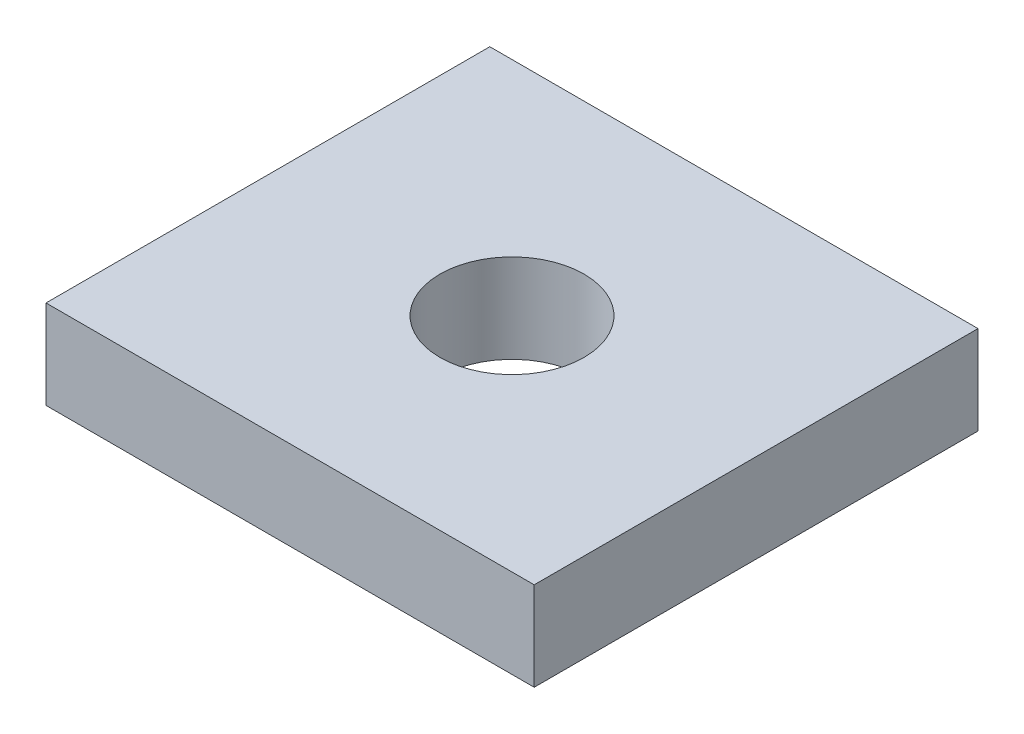
ISO-10303-21;
HEADER;
FILE_DESCRIPTION(('STEP AP214'),'2;1');
FILE_NAME('part.step','',(''),(''),'','','');
FILE_SCHEMA(('AUTOMOTIVE_DESIGN { 1 0 10303 214 1 1 1 1 }'));
ENDSEC;
DATA;
#1=APPLICATION_CONTEXT('core data for automotive mechanical design processes');
#2=APPLICATION_PROTOCOL_DEFINITION('international standard','automotive_design',2000,#1);
#3=PRODUCT_CONTEXT('',#1,'mechanical');
#4=PRODUCT('Part','Part','',(#3));
#5=PRODUCT_RELATED_PRODUCT_CATEGORY('part','',(#4));
#6=PRODUCT_DEFINITION_FORMATION('','',#4);
#7=PRODUCT_DEFINITION_CONTEXT('part definition',#1,'design');
#8=PRODUCT_DEFINITION('design','',#6,#7);
#9=PRODUCT_DEFINITION_SHAPE('','',#8);
#10=(LENGTH_UNIT() NAMED_UNIT(*) SI_UNIT(.MILLI.,.METRE.));
#11=(NAMED_UNIT(*) PLANE_ANGLE_UNIT() SI_UNIT($,.RADIAN.));
#12=(NAMED_UNIT(*) SI_UNIT($,.STERADIAN.) SOLID_ANGLE_UNIT());
#13=UNCERTAINTY_MEASURE_WITH_UNIT(LENGTH_MEASURE(1.E-05),#10,'distance_accuracy_value','');
#14=(GEOMETRIC_REPRESENTATION_CONTEXT(3) GLOBAL_UNCERTAINTY_ASSIGNED_CONTEXT((#13)) GLOBAL_UNIT_ASSIGNED_CONTEXT((#10,
#11,#12)) REPRESENTATION_CONTEXT('',''));
#15=CARTESIAN_POINT('',(0.,0.,0.));
#16=DIRECTION('',(0.,0.,1.));
#17=DIRECTION('',(1.,0.,0.));
#18=AXIS2_PLACEMENT_3D('',#15,#16,#17);
#19=CARTESIAN_POINT('',(-11.,4.,10.));
#20=DIRECTION('',(0.,1.,0.));
#21=DIRECTION('',(0.,0.,1.));
#22=AXIS2_PLACEMENT_3D('',#19,#20,#21);
#23=PLANE('',#22);
#24=DIRECTION('',(0.,0.,1.));
#25=VECTOR('',#24,1.);
#26=CARTESIAN_POINT('',(-11.,4.,-10.));
#27=LINE('',#26,#25);
#28=CARTESIAN_POINT('',(-11.,4.,-10.));
#29=VERTEX_POINT('',#28);
#30=CARTESIAN_POINT('',(-11.,4.,10.));
#31=VERTEX_POINT('',#30);
#32=EDGE_CURVE('E86',#29,#31,#27,.T.);
#33=ORIENTED_EDGE('',*,*,#32,.T.);
#34=DIRECTION('',(1.,0.,0.));
#35=VECTOR('',#34,1.);
#36=CARTESIAN_POINT('',(-11.,4.,10.));
#37=LINE('',#36,#35);
#38=CARTESIAN_POINT('',(11.,4.,10.));
#39=VERTEX_POINT('',#38);
#40=EDGE_CURVE('E81',#31,#39,#37,.T.);
#41=ORIENTED_EDGE('',*,*,#40,.T.);
#42=DIRECTION('',(0.,0.,-1.));
#43=VECTOR('',#42,1.);
#44=CARTESIAN_POINT('',(11.,4.,-10.));
#45=LINE('',#44,#43);
#46=CARTESIAN_POINT('',(11.,4.,-10.));
#47=VERTEX_POINT('',#46);
#48=EDGE_CURVE('E84',#39,#47,#45,.T.);
#49=ORIENTED_EDGE('',*,*,#48,.T.);
#50=DIRECTION('',(-1.,0.,0.));
#51=VECTOR('',#50,1.);
#52=CARTESIAN_POINT('',(-11.,4.,-10.));
#53=LINE('',#52,#51);
#54=EDGE_CURVE('E51',#47,#29,#53,.T.);
#55=ORIENTED_EDGE('',*,*,#54,.T.);
#56=EDGE_LOOP('',(#33,#41,#49,#55));
#57=FACE_BOUND('',#56,.T.);
#58=CARTESIAN_POINT('',(0.,4.,0.));
#59=DIRECTION('',(0.,1.,0.));
#60=DIRECTION('',(0.,0.,1.));
#61=AXIS2_PLACEMENT_3D('',#58,#59,#60);
#62=CIRCLE('',#61,3.25);
#63=CARTESIAN_POINT('',(0.,4.,3.25));
#64=VERTEX_POINT('',#63);
#65=EDGE_CURVE('E101',#64,#64,#62,.T.);
#66=ORIENTED_EDGE('',*,*,#65,.F.);
#67=EDGE_LOOP('',(#66));
#68=FACE_BOUND('',#67,.T.);
#69=ADVANCED_FACE('F34',(#57,#68),#23,.T.);
#70=CARTESIAN_POINT('',(-11.,0.,10.));
#71=DIRECTION('',(0.,1.,0.));
#72=DIRECTION('',(0.,0.,1.));
#73=AXIS2_PLACEMENT_3D('',#70,#71,#72);
#74=PLANE('',#73);
#75=DIRECTION('',(0.,0.,1.));
#76=VECTOR('',#75,1.);
#77=CARTESIAN_POINT('',(-11.,0.,-10.));
#78=LINE('',#77,#76);
#79=CARTESIAN_POINT('',(-11.,0.,-10.));
#80=VERTEX_POINT('',#79);
#81=CARTESIAN_POINT('',(-11.,0.,10.));
#82=VERTEX_POINT('',#81);
#83=EDGE_CURVE('E98',#80,#82,#78,.T.);
#84=ORIENTED_EDGE('',*,*,#83,.F.);
#85=DIRECTION('',(-1.,0.,0.));
#86=VECTOR('',#85,1.);
#87=CARTESIAN_POINT('',(-11.,0.,-10.));
#88=LINE('',#87,#86);
#89=CARTESIAN_POINT('',(11.,0.,-10.));
#90=VERTEX_POINT('',#89);
#91=EDGE_CURVE('E74',#90,#80,#88,.T.);
#92=ORIENTED_EDGE('',*,*,#91,.F.);
#93=DIRECTION('',(0.,0.,-1.));
#94=VECTOR('',#93,1.);
#95=CARTESIAN_POINT('',(11.,0.,-10.));
#96=LINE('',#95,#94);
#97=CARTESIAN_POINT('',(11.,0.,10.));
#98=VERTEX_POINT('',#97);
#99=EDGE_CURVE('E68',#98,#90,#96,.T.);
#100=ORIENTED_EDGE('',*,*,#99,.F.);
#101=DIRECTION('',(1.,0.,0.));
#102=VECTOR('',#101,1.);
#103=CARTESIAN_POINT('',(-11.,0.,10.));
#104=LINE('',#103,#102);
#105=EDGE_CURVE('E90',#82,#98,#104,.T.);
#106=ORIENTED_EDGE('',*,*,#105,.F.);
#107=EDGE_LOOP('',(#84,#92,#100,#106));
#108=FACE_BOUND('',#107,.T.);
#109=CARTESIAN_POINT('',(0.,0.,0.));
#110=DIRECTION('',(0.,1.,0.));
#111=DIRECTION('',(0.,0.,1.));
#112=AXIS2_PLACEMENT_3D('',#109,#110,#111);
#113=CIRCLE('',#112,3.25);
#114=CARTESIAN_POINT('',(0.,0.,3.25));
#115=VERTEX_POINT('',#114);
#116=EDGE_CURVE('E113',#115,#115,#113,.T.);
#117=ORIENTED_EDGE('',*,*,#116,.T.);
#118=EDGE_LOOP('',(#117));
#119=FACE_BOUND('',#118,.T.);
#120=ADVANCED_FACE('F109',(#108,#119),#74,.F.);
#121=CARTESIAN_POINT('',(-11.,4.,-10.));
#122=DIRECTION('',(1.,0.,0.));
#123=DIRECTION('',(0.,0.,-1.));
#124=AXIS2_PLACEMENT_3D('',#121,#122,#123);
#125=PLANE('',#124);
#126=ORIENTED_EDGE('',*,*,#83,.T.);
#127=DIRECTION('',(0.,-1.,0.));
#128=VECTOR('',#127,1.);
#129=CARTESIAN_POINT('',(-11.,4.,10.));
#130=LINE('',#129,#128);
#131=EDGE_CURVE('E11',#31,#82,#130,.T.);
#132=ORIENTED_EDGE('',*,*,#131,.F.);
#133=ORIENTED_EDGE('',*,*,#32,.F.);
#134=DIRECTION('',(0.,-1.,0.));
#135=VECTOR('',#134,1.);
#136=CARTESIAN_POINT('',(-11.,4.,-10.));
#137=LINE('',#136,#135);
#138=EDGE_CURVE('E94',#29,#80,#137,.T.);
#139=ORIENTED_EDGE('',*,*,#138,.T.);
#140=EDGE_LOOP('',(#126,#132,#133,#139));
#141=FACE_BOUND('',#140,.T.);
#142=ADVANCED_FACE('F36',(#141),#125,.F.);
#143=CARTESIAN_POINT('',(-11.,4.,10.));
#144=DIRECTION('',(0.,0.,-1.));
#145=DIRECTION('',(-1.,0.,0.));
#146=AXIS2_PLACEMENT_3D('',#143,#144,#145);
#147=PLANE('',#146);
#148=ORIENTED_EDGE('',*,*,#105,.T.);
#149=DIRECTION('',(0.,-1.,0.));
#150=VECTOR('',#149,1.);
#151=CARTESIAN_POINT('',(11.,4.,10.));
#152=LINE('',#151,#150);
#153=EDGE_CURVE('E43',#39,#98,#152,.T.);
#154=ORIENTED_EDGE('',*,*,#153,.F.);
#155=ORIENTED_EDGE('',*,*,#40,.F.);
#156=ORIENTED_EDGE('',*,*,#131,.T.);
#157=EDGE_LOOP('',(#148,#154,#155,#156));
#158=FACE_BOUND('',#157,.T.);
#159=ADVANCED_FACE('F89',(#158),#147,.F.);
#160=CARTESIAN_POINT('',(11.,4.,-10.));
#161=DIRECTION('',(-1.,0.,0.));
#162=DIRECTION('',(0.,0.,1.));
#163=AXIS2_PLACEMENT_3D('',#160,#161,#162);
#164=PLANE('',#163);
#165=ORIENTED_EDGE('',*,*,#99,.T.);
#166=DIRECTION('',(0.,-1.,0.));
#167=VECTOR('',#166,1.);
#168=CARTESIAN_POINT('',(11.,4.,-10.));
#169=LINE('',#168,#167);
#170=EDGE_CURVE('E91',#47,#90,#169,.T.);
#171=ORIENTED_EDGE('',*,*,#170,.F.);
#172=ORIENTED_EDGE('',*,*,#48,.F.);
#173=ORIENTED_EDGE('',*,*,#153,.T.);
#174=EDGE_LOOP('',(#165,#171,#172,#173));
#175=FACE_BOUND('',#174,.T.);
#176=ADVANCED_FACE('F92',(#175),#164,.F.);
#177=CARTESIAN_POINT('',(-11.,4.,-10.));
#178=DIRECTION('',(0.,0.,1.));
#179=DIRECTION('',(1.,0.,0.));
#180=AXIS2_PLACEMENT_3D('',#177,#178,#179);
#181=PLANE('',#180);
#182=ORIENTED_EDGE('',*,*,#91,.T.);
#183=ORIENTED_EDGE('',*,*,#138,.F.);
#184=ORIENTED_EDGE('',*,*,#54,.F.);
#185=ORIENTED_EDGE('',*,*,#170,.T.);
#186=EDGE_LOOP('',(#182,#183,#184,#185));
#187=FACE_BOUND('',#186,.T.);
#188=ADVANCED_FACE('F106',(#187),#181,.F.);
#189=CARTESIAN_POINT('',(0.,4.,0.));
#190=DIRECTION('',(0.,-1.,0.));
#191=DIRECTION('',(0.,0.,-1.));
#192=AXIS2_PLACEMENT_3D('',#189,#190,#191);
#193=CYLINDRICAL_SURFACE('',#192,3.25);
#194=ORIENTED_EDGE('',*,*,#65,.T.);
#195=EDGE_LOOP('',(#194));
#196=FACE_BOUND('',#195,.T.);
#197=ORIENTED_EDGE('',*,*,#116,.F.);
#198=EDGE_LOOP('',(#197));
#199=FACE_BOUND('',#198,.T.);
#200=ADVANCED_FACE('F119',(#196,#199),#193,.F.);
#201=CLOSED_SHELL('',(#69,#120,#142,#159,#176,#188,#200));
#202=MANIFOLD_SOLID_BREP('B2',#201);
#203=ADVANCED_BREP_SHAPE_REPRESENTATION('',(#18,#202),#14);
#204=SHAPE_DEFINITION_REPRESENTATION(#9,#203);
ENDSEC;
END-ISO-10303-21;
